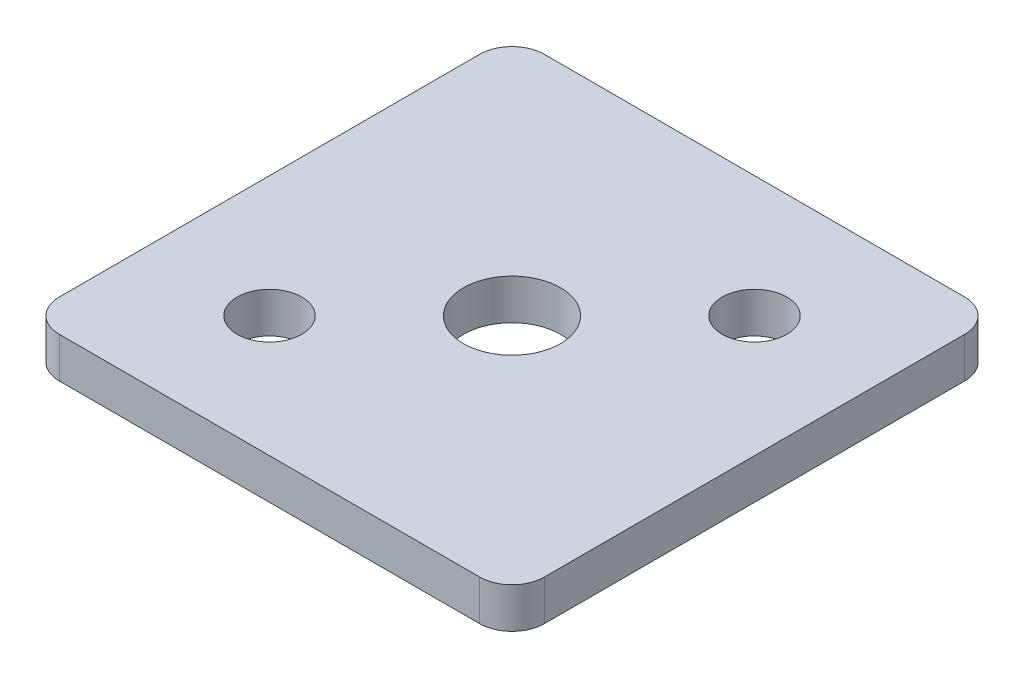
ISO-10303-21;
HEADER;
FILE_DESCRIPTION(('STEP AP214'),'2;1');
FILE_NAME('part.step','',(''),(''),'','','');
FILE_SCHEMA(('AUTOMOTIVE_DESIGN { 1 0 10303 214 1 1 1 1 }'));
ENDSEC;
DATA;
#1=APPLICATION_CONTEXT('core data for automotive mechanical design processes');
#2=APPLICATION_PROTOCOL_DEFINITION('international standard','automotive_design',2000,#1);
#3=PRODUCT_CONTEXT('',#1,'mechanical');
#4=PRODUCT('Part','Part','',(#3));
#5=PRODUCT_RELATED_PRODUCT_CATEGORY('part','',(#4));
#6=PRODUCT_DEFINITION_FORMATION('','',#4);
#7=PRODUCT_DEFINITION_CONTEXT('part definition',#1,'design');
#8=PRODUCT_DEFINITION('design','',#6,#7);
#9=PRODUCT_DEFINITION_SHAPE('','',#8);
#10=(LENGTH_UNIT() NAMED_UNIT(*) SI_UNIT(.MILLI.,.METRE.));
#11=(NAMED_UNIT(*) PLANE_ANGLE_UNIT() SI_UNIT($,.RADIAN.));
#12=(NAMED_UNIT(*) SI_UNIT($,.STERADIAN.) SOLID_ANGLE_UNIT());
#13=UNCERTAINTY_MEASURE_WITH_UNIT(LENGTH_MEASURE(1.E-05),#10,'distance_accuracy_value','');
#14=(GEOMETRIC_REPRESENTATION_CONTEXT(3) GLOBAL_UNCERTAINTY_ASSIGNED_CONTEXT((#13)) GLOBAL_UNIT_ASSIGNED_CONTEXT((#10,
#11,#12)) REPRESENTATION_CONTEXT('',''));
#15=CARTESIAN_POINT('',(0.,0.,0.));
#16=DIRECTION('',(0.,0.,1.));
#17=DIRECTION('',(1.,0.,0.));
#18=AXIS2_PLACEMENT_3D('',#15,#16,#17);
#19=CARTESIAN_POINT('',(0.,3.175,0.));
#20=DIRECTION('',(0.,1.,0.));
#21=DIRECTION('',(0.,0.,1.));
#22=AXIS2_PLACEMENT_3D('',#19,#20,#21);
#23=PLANE('',#22);
#24=CARTESIAN_POINT('',(-9.525,3.175,9.525));
#25=DIRECTION('',(0.,1.,0.));
#26=DIRECTION('',(0.,0.,1.));
#27=AXIS2_PLACEMENT_3D('',#24,#25,#26);
#28=CIRCLE('',#27,2.54);
#29=CARTESIAN_POINT('',(-9.525,3.175,12.065));
#30=VERTEX_POINT('',#29);
#31=EDGE_CURVE('E181',#30,#30,#28,.T.);
#32=ORIENTED_EDGE('',*,*,#31,.F.);
#33=EDGE_LOOP('',(#32));
#34=FACE_BOUND('',#33,.T.);
#35=DIRECTION('',(-1.,0.,0.));
#36=VECTOR('',#35,1.);
#37=CARTESIAN_POINT('',(-19.05,3.175,-19.05));
#38=LINE('',#37,#36);
#39=CARTESIAN_POINT('',(16.51,3.175,-19.05));
#40=VERTEX_POINT('',#39);
#41=CARTESIAN_POINT('',(-16.51,3.175,-19.05));
#42=VERTEX_POINT('',#41);
#43=EDGE_CURVE('E136',#40,#42,#38,.T.);
#44=ORIENTED_EDGE('',*,*,#43,.T.);
#45=CARTESIAN_POINT('',(-16.51,3.175,-16.51));
#46=DIRECTION('',(0.,1.,0.));
#47=DIRECTION('',(0.,0.,1.));
#48=AXIS2_PLACEMENT_3D('',#45,#46,#47);
#49=CIRCLE('',#48,2.54);
#50=CARTESIAN_POINT('',(-19.05,3.175,-16.51));
#51=VERTEX_POINT('',#50);
#52=EDGE_CURVE('E155',#42,#51,#49,.T.);
#53=ORIENTED_EDGE('',*,*,#52,.T.);
#54=DIRECTION('',(0.,0.,1.));
#55=VECTOR('',#54,1.);
#56=CARTESIAN_POINT('',(-19.05,3.175,-19.05));
#57=LINE('',#56,#55);
#58=CARTESIAN_POINT('',(-19.05,3.175,16.51));
#59=VERTEX_POINT('',#58);
#60=EDGE_CURVE('E119',#51,#59,#57,.T.);
#61=ORIENTED_EDGE('',*,*,#60,.T.);
#62=CARTESIAN_POINT('',(-16.51,3.175,16.51));
#63=DIRECTION('',(0.,1.,0.));
#64=DIRECTION('',(0.,0.,1.));
#65=AXIS2_PLACEMENT_3D('',#62,#63,#64);
#66=CIRCLE('',#65,2.54);
#67=CARTESIAN_POINT('',(-16.51,3.175,19.05));
#68=VERTEX_POINT('',#67);
#69=EDGE_CURVE('E150',#59,#68,#66,.T.);
#70=ORIENTED_EDGE('',*,*,#69,.T.);
#71=DIRECTION('',(1.,0.,0.));
#72=VECTOR('',#71,1.);
#73=CARTESIAN_POINT('',(-19.05,3.175,19.05));
#74=LINE('',#73,#72);
#75=CARTESIAN_POINT('',(16.51,3.175,19.05));
#76=VERTEX_POINT('',#75);
#77=EDGE_CURVE('E166',#68,#76,#74,.T.);
#78=ORIENTED_EDGE('',*,*,#77,.T.);
#79=CARTESIAN_POINT('',(16.51,3.175,16.51));
#80=DIRECTION('',(0.,1.,0.));
#81=DIRECTION('',(0.,0.,1.));
#82=AXIS2_PLACEMENT_3D('',#79,#80,#81);
#83=CIRCLE('',#82,2.54);
#84=CARTESIAN_POINT('',(19.05,3.175,16.51));
#85=VERTEX_POINT('',#84);
#86=EDGE_CURVE('E55',#76,#85,#83,.T.);
#87=ORIENTED_EDGE('',*,*,#86,.T.);
#88=DIRECTION('',(0.,0.,-1.));
#89=VECTOR('',#88,1.);
#90=CARTESIAN_POINT('',(19.05,3.175,-19.05));
#91=LINE('',#90,#89);
#92=CARTESIAN_POINT('',(19.05,3.175,-16.51));
#93=VERTEX_POINT('',#92);
#94=EDGE_CURVE('E174',#85,#93,#91,.T.);
#95=ORIENTED_EDGE('',*,*,#94,.T.);
#96=CARTESIAN_POINT('',(16.51,3.175,-16.51));
#97=DIRECTION('',(0.,1.,0.));
#98=DIRECTION('',(0.,0.,1.));
#99=AXIS2_PLACEMENT_3D('',#96,#97,#98);
#100=CIRCLE('',#99,2.54);
#101=EDGE_CURVE('E153',#93,#40,#100,.T.);
#102=ORIENTED_EDGE('',*,*,#101,.T.);
#103=EDGE_LOOP('',(#44,#53,#61,#70,#78,#87,#95,#102));
#104=FACE_BOUND('',#103,.T.);
#105=CARTESIAN_POINT('',(9.525,3.175,-9.525));
#106=DIRECTION('',(0.,1.,0.));
#107=DIRECTION('',(0.,0.,1.));
#108=AXIS2_PLACEMENT_3D('',#105,#106,#107);
#109=CIRCLE('',#108,2.54);
#110=CARTESIAN_POINT('',(9.525,3.175,-6.985));
#111=VERTEX_POINT('',#110);
#112=EDGE_CURVE('E127',#111,#111,#109,.T.);
#113=ORIENTED_EDGE('',*,*,#112,.F.);
#114=EDGE_LOOP('',(#113));
#115=FACE_BOUND('',#114,.T.);
#116=CARTESIAN_POINT('',(0.,3.175,0.));
#117=DIRECTION('',(0.,1.,0.));
#118=DIRECTION('',(0.,0.,1.));
#119=AXIS2_PLACEMENT_3D('',#116,#117,#118);
#120=CIRCLE('',#119,3.81);
#121=CARTESIAN_POINT('',(0.,3.175,3.81));
#122=VERTEX_POINT('',#121);
#123=EDGE_CURVE('E186',#122,#122,#120,.T.);
#124=ORIENTED_EDGE('',*,*,#123,.F.);
#125=EDGE_LOOP('',(#124));
#126=FACE_BOUND('',#125,.T.);
#127=ADVANCED_FACE('F33',(#34,#104,#115,#126),#23,.T.);
#128=CARTESIAN_POINT('',(0.,0.,0.));
#129=DIRECTION('',(0.,1.,0.));
#130=DIRECTION('',(0.,0.,1.));
#131=AXIS2_PLACEMENT_3D('',#128,#129,#130);
#132=PLANE('',#131);
#133=CARTESIAN_POINT('',(-9.525,0.,9.525));
#134=DIRECTION('',(0.,1.,0.));
#135=DIRECTION('',(0.,0.,1.));
#136=AXIS2_PLACEMENT_3D('',#133,#134,#135);
#137=CIRCLE('',#136,2.54);
#138=CARTESIAN_POINT('',(-9.525,0.,12.065));
#139=VERTEX_POINT('',#138);
#140=EDGE_CURVE('E183',#139,#139,#137,.T.);
#141=ORIENTED_EDGE('',*,*,#140,.T.);
#142=EDGE_LOOP('',(#141));
#143=FACE_BOUND('',#142,.T.);
#144=DIRECTION('',(0.,0.,1.));
#145=VECTOR('',#144,1.);
#146=CARTESIAN_POINT('',(-19.05,0.,-19.05));
#147=LINE('',#146,#145);
#148=CARTESIAN_POINT('',(-19.05,0.,-16.51));
#149=VERTEX_POINT('',#148);
#150=CARTESIAN_POINT('',(-19.05,0.,16.51));
#151=VERTEX_POINT('',#150);
#152=EDGE_CURVE('E116',#149,#151,#147,.T.);
#153=ORIENTED_EDGE('',*,*,#152,.F.);
#154=CARTESIAN_POINT('',(-16.51,0.,-16.51));
#155=DIRECTION('',(0.,1.,0.));
#156=DIRECTION('',(0.,0.,1.));
#157=AXIS2_PLACEMENT_3D('',#154,#155,#156);
#158=CIRCLE('',#157,2.54);
#159=CARTESIAN_POINT('',(-16.51,0.,-19.05));
#160=VERTEX_POINT('',#159);
#161=EDGE_CURVE('E99',#149,#160,#158,.F.);
#162=ORIENTED_EDGE('',*,*,#161,.T.);
#163=DIRECTION('',(-1.,0.,0.));
#164=VECTOR('',#163,1.);
#165=CARTESIAN_POINT('',(-19.05,0.,-19.05));
#166=LINE('',#165,#164);
#167=CARTESIAN_POINT('',(16.51,0.,-19.05));
#168=VERTEX_POINT('',#167);
#169=EDGE_CURVE('E140',#168,#160,#166,.T.);
#170=ORIENTED_EDGE('',*,*,#169,.F.);
#171=CARTESIAN_POINT('',(16.51,0.,-16.51));
#172=DIRECTION('',(0.,1.,0.));
#173=DIRECTION('',(0.,0.,1.));
#174=AXIS2_PLACEMENT_3D('',#171,#172,#173);
#175=CIRCLE('',#174,2.54);
#176=CARTESIAN_POINT('',(19.05,0.,-16.51));
#177=VERTEX_POINT('',#176);
#178=EDGE_CURVE('E110',#168,#177,#175,.F.);
#179=ORIENTED_EDGE('',*,*,#178,.T.);
#180=DIRECTION('',(0.,0.,-1.));
#181=VECTOR('',#180,1.);
#182=CARTESIAN_POINT('',(19.05,0.,-19.05));
#183=LINE('',#182,#181);
#184=CARTESIAN_POINT('',(19.05,0.,16.51));
#185=VERTEX_POINT('',#184);
#186=EDGE_CURVE('E130',#185,#177,#183,.T.);
#187=ORIENTED_EDGE('',*,*,#186,.F.);
#188=CARTESIAN_POINT('',(16.51,0.,16.51));
#189=DIRECTION('',(0.,1.,0.));
#190=DIRECTION('',(0.,0.,1.));
#191=AXIS2_PLACEMENT_3D('',#188,#189,#190);
#192=CIRCLE('',#191,2.54);
#193=CARTESIAN_POINT('',(16.51,0.,19.05));
#194=VERTEX_POINT('',#193);
#195=EDGE_CURVE('E144',#185,#194,#192,.F.);
#196=ORIENTED_EDGE('',*,*,#195,.T.);
#197=DIRECTION('',(1.,0.,0.));
#198=VECTOR('',#197,1.);
#199=CARTESIAN_POINT('',(-19.05,0.,19.05));
#200=LINE('',#199,#198);
#201=CARTESIAN_POINT('',(-16.51,0.,19.05));
#202=VERTEX_POINT('',#201);
#203=EDGE_CURVE('E126',#202,#194,#200,.T.);
#204=ORIENTED_EDGE('',*,*,#203,.F.);
#205=CARTESIAN_POINT('',(-16.51,0.,16.51));
#206=DIRECTION('',(0.,1.,0.));
#207=DIRECTION('',(0.,0.,1.));
#208=AXIS2_PLACEMENT_3D('',#205,#206,#207);
#209=CIRCLE('',#208,2.54);
#210=EDGE_CURVE('E120',#202,#151,#209,.F.);
#211=ORIENTED_EDGE('',*,*,#210,.T.);
#212=EDGE_LOOP('',(#153,#162,#170,#179,#187,#196,#204,#211));
#213=FACE_BOUND('',#212,.T.);
#214=CARTESIAN_POINT('',(9.525,0.,-9.525));
#215=DIRECTION('',(0.,1.,0.));
#216=DIRECTION('',(0.,0.,1.));
#217=AXIS2_PLACEMENT_3D('',#214,#215,#216);
#218=CIRCLE('',#217,2.54);
#219=CARTESIAN_POINT('',(9.525,0.,-6.985));
#220=VERTEX_POINT('',#219);
#221=EDGE_CURVE('E133',#220,#220,#218,.T.);
#222=ORIENTED_EDGE('',*,*,#221,.T.);
#223=EDGE_LOOP('',(#222));
#224=FACE_BOUND('',#223,.T.);
#225=CARTESIAN_POINT('',(0.,0.,0.));
#226=DIRECTION('',(0.,1.,0.));
#227=DIRECTION('',(0.,0.,1.));
#228=AXIS2_PLACEMENT_3D('',#225,#226,#227);
#229=CIRCLE('',#228,3.81);
#230=CARTESIAN_POINT('',(0.,0.,3.81));
#231=VERTEX_POINT('',#230);
#232=EDGE_CURVE('E189',#231,#231,#229,.T.);
#233=ORIENTED_EDGE('',*,*,#232,.T.);
#234=EDGE_LOOP('',(#233));
#235=FACE_BOUND('',#234,.T.);
#236=ADVANCED_FACE('F123',(#143,#213,#224,#235),#132,.F.);
#237=CARTESIAN_POINT('',(-19.05,3.175,-19.05));
#238=DIRECTION('',(1.,0.,0.));
#239=DIRECTION('',(0.,0.,-1.));
#240=AXIS2_PLACEMENT_3D('',#237,#238,#239);
#241=PLANE('',#240);
#242=ORIENTED_EDGE('',*,*,#60,.F.);
#243=DIRECTION('',(0.,-1.,0.));
#244=VECTOR('',#243,1.);
#245=CARTESIAN_POINT('',(-19.05,3.175,-16.51));
#246=LINE('',#245,#244);
#247=EDGE_CURVE('E103',#51,#149,#246,.T.);
#248=ORIENTED_EDGE('',*,*,#247,.T.);
#249=ORIENTED_EDGE('',*,*,#152,.T.);
#250=DIRECTION('',(0.,-1.,0.));
#251=VECTOR('',#250,1.);
#252=CARTESIAN_POINT('',(-19.05,3.175,16.51));
#253=LINE('',#252,#251);
#254=EDGE_CURVE('E121',#151,#59,#253,.F.);
#255=ORIENTED_EDGE('',*,*,#254,.T.);
#256=EDGE_LOOP('',(#242,#248,#249,#255));
#257=FACE_BOUND('',#256,.T.);
#258=ADVANCED_FACE('F115',(#257),#241,.F.);
#259=CARTESIAN_POINT('',(-19.05,3.175,19.05));
#260=DIRECTION('',(0.,0.,-1.));
#261=DIRECTION('',(-1.,0.,0.));
#262=AXIS2_PLACEMENT_3D('',#259,#260,#261);
#263=PLANE('',#262);
#264=ORIENTED_EDGE('',*,*,#203,.T.);
#265=DIRECTION('',(0.,-1.,0.));
#266=VECTOR('',#265,1.);
#267=CARTESIAN_POINT('',(16.51,3.175,19.05));
#268=LINE('',#267,#266);
#269=EDGE_CURVE('E11',#194,#76,#268,.F.);
#270=ORIENTED_EDGE('',*,*,#269,.T.);
#271=ORIENTED_EDGE('',*,*,#77,.F.);
#272=DIRECTION('',(0.,-1.,0.));
#273=VECTOR('',#272,1.);
#274=CARTESIAN_POINT('',(-16.51,3.175,19.05));
#275=LINE('',#274,#273);
#276=EDGE_CURVE('E41',#68,#202,#275,.T.);
#277=ORIENTED_EDGE('',*,*,#276,.T.);
#278=EDGE_LOOP('',(#264,#270,#271,#277));
#279=FACE_BOUND('',#278,.T.);
#280=ADVANCED_FACE('F164',(#279),#263,.F.);
#281=CARTESIAN_POINT('',(19.05,3.175,-19.05));
#282=DIRECTION('',(-1.,0.,0.));
#283=DIRECTION('',(0.,0.,1.));
#284=AXIS2_PLACEMENT_3D('',#281,#282,#283);
#285=PLANE('',#284);
#286=ORIENTED_EDGE('',*,*,#186,.T.);
#287=DIRECTION('',(0.,-1.,0.));
#288=VECTOR('',#287,1.);
#289=CARTESIAN_POINT('',(19.05,3.175,-16.51));
#290=LINE('',#289,#288);
#291=EDGE_CURVE('E48',#177,#93,#290,.F.);
#292=ORIENTED_EDGE('',*,*,#291,.T.);
#293=ORIENTED_EDGE('',*,*,#94,.F.);
#294=DIRECTION('',(0.,-1.,0.));
#295=VECTOR('',#294,1.);
#296=CARTESIAN_POINT('',(19.05,3.175,16.51));
#297=LINE('',#296,#295);
#298=EDGE_CURVE('E157',#85,#185,#297,.T.);
#299=ORIENTED_EDGE('',*,*,#298,.T.);
#300=EDGE_LOOP('',(#286,#292,#293,#299));
#301=FACE_BOUND('',#300,.T.);
#302=ADVANCED_FACE('F173',(#301),#285,.F.);
#303=CARTESIAN_POINT('',(-19.05,3.175,-19.05));
#304=DIRECTION('',(0.,0.,1.));
#305=DIRECTION('',(1.,0.,0.));
#306=AXIS2_PLACEMENT_3D('',#303,#304,#305);
#307=PLANE('',#306);
#308=ORIENTED_EDGE('',*,*,#169,.T.);
#309=DIRECTION('',(0.,-1.,0.));
#310=VECTOR('',#309,1.);
#311=CARTESIAN_POINT('',(-16.51,3.175,-19.05));
#312=LINE('',#311,#310);
#313=EDGE_CURVE('E104',#160,#42,#312,.F.);
#314=ORIENTED_EDGE('',*,*,#313,.T.);
#315=ORIENTED_EDGE('',*,*,#43,.F.);
#316=DIRECTION('',(0.,-1.,0.));
#317=VECTOR('',#316,1.);
#318=CARTESIAN_POINT('',(16.51,3.175,-19.05));
#319=LINE('',#318,#317);
#320=EDGE_CURVE('E109',#40,#168,#319,.T.);
#321=ORIENTED_EDGE('',*,*,#320,.T.);
#322=EDGE_LOOP('',(#308,#314,#315,#321));
#323=FACE_BOUND('',#322,.T.);
#324=ADVANCED_FACE('F211',(#323),#307,.F.);
#325=CARTESIAN_POINT('',(9.525,3.175,-9.525));
#326=DIRECTION('',(0.,-1.,0.));
#327=DIRECTION('',(0.,0.,-1.));
#328=AXIS2_PLACEMENT_3D('',#325,#326,#327);
#329=CYLINDRICAL_SURFACE('',#328,2.54);
#330=ORIENTED_EDGE('',*,*,#112,.T.);
#331=EDGE_LOOP('',(#330));
#332=FACE_BOUND('',#331,.T.);
#333=ORIENTED_EDGE('',*,*,#221,.F.);
#334=EDGE_LOOP('',(#333));
#335=FACE_BOUND('',#334,.T.);
#336=ADVANCED_FACE('F208',(#332,#335),#329,.F.);
#337=CARTESIAN_POINT('',(-9.525,3.175,9.525));
#338=DIRECTION('',(0.,-1.,0.));
#339=DIRECTION('',(0.,0.,-1.));
#340=AXIS2_PLACEMENT_3D('',#337,#338,#339);
#341=CYLINDRICAL_SURFACE('',#340,2.54);
#342=ORIENTED_EDGE('',*,*,#31,.T.);
#343=EDGE_LOOP('',(#342));
#344=FACE_BOUND('',#343,.T.);
#345=ORIENTED_EDGE('',*,*,#140,.F.);
#346=EDGE_LOOP('',(#345));
#347=FACE_BOUND('',#346,.T.);
#348=ADVANCED_FACE('F239',(#344,#347),#341,.F.);
#349=CARTESIAN_POINT('',(0.,3.175,0.));
#350=DIRECTION('',(0.,-1.,0.));
#351=DIRECTION('',(0.,0.,-1.));
#352=AXIS2_PLACEMENT_3D('',#349,#350,#351);
#353=CYLINDRICAL_SURFACE('',#352,3.81);
#354=ORIENTED_EDGE('',*,*,#123,.T.);
#355=EDGE_LOOP('',(#354));
#356=FACE_BOUND('',#355,.T.);
#357=ORIENTED_EDGE('',*,*,#232,.F.);
#358=EDGE_LOOP('',(#357));
#359=FACE_BOUND('',#358,.T.);
#360=ADVANCED_FACE('F195',(#356,#359),#353,.F.);
#361=CARTESIAN_POINT('',(-16.51,3.175,-16.51));
#362=DIRECTION('',(0.,-1.,0.));
#363=DIRECTION('',(0.,0.,-1.));
#364=AXIS2_PLACEMENT_3D('',#361,#362,#363);
#365=CYLINDRICAL_SURFACE('',#364,2.54);
#366=ORIENTED_EDGE('',*,*,#52,.F.);
#367=ORIENTED_EDGE('',*,*,#313,.F.);
#368=ORIENTED_EDGE('',*,*,#161,.F.);
#369=ORIENTED_EDGE('',*,*,#247,.F.);
#370=EDGE_LOOP('',(#366,#367,#368,#369));
#371=FACE_BOUND('',#370,.T.);
#372=ADVANCED_FACE('F102',(#371),#365,.T.);
#373=CARTESIAN_POINT('',(16.51,3.175,-16.51));
#374=DIRECTION('',(0.,-1.,0.));
#375=DIRECTION('',(0.,0.,-1.));
#376=AXIS2_PLACEMENT_3D('',#373,#374,#375);
#377=CYLINDRICAL_SURFACE('',#376,2.54);
#378=ORIENTED_EDGE('',*,*,#101,.F.);
#379=ORIENTED_EDGE('',*,*,#291,.F.);
#380=ORIENTED_EDGE('',*,*,#178,.F.);
#381=ORIENTED_EDGE('',*,*,#320,.F.);
#382=EDGE_LOOP('',(#378,#379,#380,#381));
#383=FACE_BOUND('',#382,.T.);
#384=ADVANCED_FACE('F223',(#383),#377,.T.);
#385=CARTESIAN_POINT('',(16.51,3.175,16.51));
#386=DIRECTION('',(0.,-1.,0.));
#387=DIRECTION('',(0.,0.,-1.));
#388=AXIS2_PLACEMENT_3D('',#385,#386,#387);
#389=CYLINDRICAL_SURFACE('',#388,2.54);
#390=ORIENTED_EDGE('',*,*,#86,.F.);
#391=ORIENTED_EDGE('',*,*,#269,.F.);
#392=ORIENTED_EDGE('',*,*,#195,.F.);
#393=ORIENTED_EDGE('',*,*,#298,.F.);
#394=EDGE_LOOP('',(#390,#391,#392,#393));
#395=FACE_BOUND('',#394,.T.);
#396=ADVANCED_FACE('F172',(#395),#389,.T.);
#397=CARTESIAN_POINT('',(-16.51,3.175,16.51));
#398=DIRECTION('',(0.,-1.,0.));
#399=DIRECTION('',(0.,0.,-1.));
#400=AXIS2_PLACEMENT_3D('',#397,#398,#399);
#401=CYLINDRICAL_SURFACE('',#400,2.54);
#402=ORIENTED_EDGE('',*,*,#69,.F.);
#403=ORIENTED_EDGE('',*,*,#254,.F.);
#404=ORIENTED_EDGE('',*,*,#210,.F.);
#405=ORIENTED_EDGE('',*,*,#276,.F.);
#406=EDGE_LOOP('',(#402,#403,#404,#405));
#407=FACE_BOUND('',#406,.T.);
#408=ADVANCED_FACE('F35',(#407),#401,.T.);
#409=CLOSED_SHELL('',(#127,#236,#258,#280,#302,#324,#336,#348,#360,#372,#384,#396,#408));
#410=MANIFOLD_SOLID_BREP('B2',#409);
#411=ADVANCED_BREP_SHAPE_REPRESENTATION('',(#18,#410),#14);
#412=SHAPE_DEFINITION_REPRESENTATION(#9,#411);
ENDSEC;
END-ISO-10303-21;
